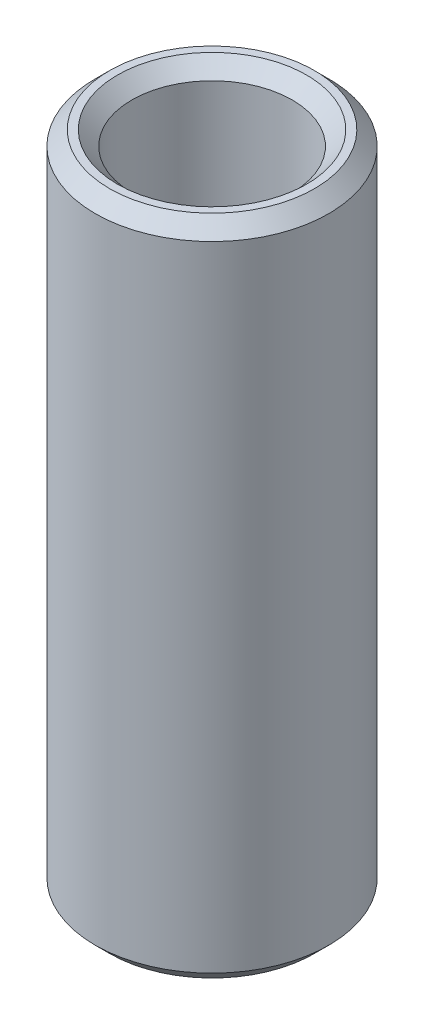
ISO-10303-21;
HEADER;
FILE_DESCRIPTION(('STEP AP214'),'2;1');
FILE_NAME('part.step','',(''),(''),'','','');
FILE_SCHEMA(('AUTOMOTIVE_DESIGN { 1 0 10303 214 1 1 1 1 }'));
ENDSEC;
DATA;
#1=APPLICATION_CONTEXT('core data for automotive mechanical design processes');
#2=APPLICATION_PROTOCOL_DEFINITION('international standard','automotive_design',2000,#1);
#3=PRODUCT_CONTEXT('',#1,'mechanical');
#4=PRODUCT('Part','Part','',(#3));
#5=PRODUCT_RELATED_PRODUCT_CATEGORY('part','',(#4));
#6=PRODUCT_DEFINITION_FORMATION('','',#4);
#7=PRODUCT_DEFINITION_CONTEXT('part definition',#1,'design');
#8=PRODUCT_DEFINITION('design','',#6,#7);
#9=PRODUCT_DEFINITION_SHAPE('','',#8);
#10=(LENGTH_UNIT() NAMED_UNIT(*) SI_UNIT(.MILLI.,.METRE.));
#11=(NAMED_UNIT(*) PLANE_ANGLE_UNIT() SI_UNIT($,.RADIAN.));
#12=(NAMED_UNIT(*) SI_UNIT($,.STERADIAN.) SOLID_ANGLE_UNIT());
#13=UNCERTAINTY_MEASURE_WITH_UNIT(LENGTH_MEASURE(1.E-05),#10,'distance_accuracy_value','');
#14=(GEOMETRIC_REPRESENTATION_CONTEXT(3) GLOBAL_UNCERTAINTY_ASSIGNED_CONTEXT((#13)) GLOBAL_UNIT_ASSIGNED_CONTEXT((#10,
#11,#12)) REPRESENTATION_CONTEXT('',''));
#15=CARTESIAN_POINT('',(0.,0.,0.));
#16=DIRECTION('',(0.,0.,1.));
#17=DIRECTION('',(1.,0.,0.));
#18=AXIS2_PLACEMENT_3D('',#15,#16,#17);
#19=CARTESIAN_POINT('',(0.,155.965716364162,0.));
#20=DIRECTION('',(0.,-1.,0.));
#21=DIRECTION('',(0.,0.,-1.));
#22=AXIS2_PLACEMENT_3D('',#19,#20,#21);
#23=CYLINDRICAL_SURFACE('',#22,27.5);
#24=CARTESIAN_POINT('',(0.,3.38961563517129,0.));
#25=DIRECTION('',(0.,1.,0.));
#26=DIRECTION('',(0.,0.,1.));
#27=AXIS2_PLACEMENT_3D('',#24,#25,#26);
#28=CIRCLE('',#27,27.5);
#29=CARTESIAN_POINT('',(0.,3.38961563517129,27.5));
#30=VERTEX_POINT('',#29);
#31=EDGE_CURVE('E10',#30,#30,#28,.T.);
#32=ORIENTED_EDGE('',*,*,#31,.T.);
#33=EDGE_LOOP('',(#32));
#34=FACE_BOUND('',#33,.T.);
#35=CARTESIAN_POINT('',(0.,152.57610072899,0.));
#36=DIRECTION('',(0.,1.,0.));
#37=DIRECTION('',(0.,0.,1.));
#38=AXIS2_PLACEMENT_3D('',#35,#36,#37);
#39=CIRCLE('',#38,27.5);
#40=CARTESIAN_POINT('',(0.,152.57610072899,27.5));
#41=VERTEX_POINT('',#40);
#42=EDGE_CURVE('E50',#41,#41,#39,.F.);
#43=ORIENTED_EDGE('',*,*,#42,.T.);
#44=EDGE_LOOP('',(#43));
#45=FACE_BOUND('',#44,.T.);
#46=ADVANCED_FACE('F39',(#34,#45),#23,.T.);
#47=CARTESIAN_POINT('',(0.,155.965716364162,0.));
#48=DIRECTION('',(0.,1.,0.));
#49=DIRECTION('',(0.,0.,1.));
#50=AXIS2_PLACEMENT_3D('',#47,#48,#49);
#51=PLANE('',#50);
#52=CARTESIAN_POINT('',(0.,155.965716364162,0.));
#53=DIRECTION('',(0.,1.,0.));
#54=DIRECTION('',(0.,0.,1.));
#55=AXIS2_PLACEMENT_3D('',#52,#53,#54);
#56=CIRCLE('',#55,22.2746414715789);
#57=CARTESIAN_POINT('',(0.,155.965716364162,22.2746414715789));
#58=VERTEX_POINT('',#57);
#59=EDGE_CURVE('E58',#58,#58,#56,.F.);
#60=ORIENTED_EDGE('',*,*,#59,.T.);
#61=EDGE_LOOP('',(#60));
#62=FACE_BOUND('',#61,.T.);
#63=CARTESIAN_POINT('',(0.,155.965716364162,0.));
#64=DIRECTION('',(0.,1.,0.));
#65=DIRECTION('',(0.,0.,1.));
#66=AXIS2_PLACEMENT_3D('',#63,#64,#65);
#67=CIRCLE('',#66,24.1103843648287);
#68=CARTESIAN_POINT('',(0.,155.965716364162,24.1103843648287));
#69=VERTEX_POINT('',#68);
#70=EDGE_CURVE('E61',#69,#69,#67,.T.);
#71=ORIENTED_EDGE('',*,*,#70,.T.);
#72=EDGE_LOOP('',(#71));
#73=FACE_BOUND('',#72,.T.);
#74=ADVANCED_FACE('F88',(#62,#73),#51,.T.);
#75=CARTESIAN_POINT('',(0.,0.,0.));
#76=DIRECTION('',(0.,1.,0.));
#77=DIRECTION('',(0.,0.,1.));
#78=AXIS2_PLACEMENT_3D('',#75,#76,#77);
#79=PLANE('',#78);
#80=CARTESIAN_POINT('',(0.,0.,0.));
#81=DIRECTION('',(0.,1.,0.));
#82=DIRECTION('',(0.,0.,1.));
#83=AXIS2_PLACEMENT_3D('',#80,#81,#82);
#84=CIRCLE('',#83,22.2746414715789);
#85=CARTESIAN_POINT('',(0.,0.,22.2746414715789));
#86=VERTEX_POINT('',#85);
#87=EDGE_CURVE('E51',#86,#86,#84,.T.);
#88=ORIENTED_EDGE('',*,*,#87,.T.);
#89=EDGE_LOOP('',(#88));
#90=FACE_BOUND('',#89,.T.);
#91=CARTESIAN_POINT('',(0.,0.,0.));
#92=DIRECTION('',(0.,1.,0.));
#93=DIRECTION('',(0.,0.,1.));
#94=AXIS2_PLACEMENT_3D('',#91,#92,#93);
#95=CIRCLE('',#94,24.1103843648287);
#96=CARTESIAN_POINT('',(0.,0.,24.1103843648287));
#97=VERTEX_POINT('',#96);
#98=EDGE_CURVE('E54',#97,#97,#95,.F.);
#99=ORIENTED_EDGE('',*,*,#98,.T.);
#100=EDGE_LOOP('',(#99));
#101=FACE_BOUND('',#100,.T.);
#102=ADVANCED_FACE('F83',(#90,#101),#79,.F.);
#103=CARTESIAN_POINT('',(0.,155.965716364162,0.));
#104=DIRECTION('',(0.,-1.,0.));
#105=DIRECTION('',(0.,0.,-1.));
#106=AXIS2_PLACEMENT_3D('',#103,#104,#105);
#107=CYLINDRICAL_SURFACE('',#106,18.8850258364076);
#108=CARTESIAN_POINT('',(0.,152.57610072899,0.));
#109=DIRECTION('',(0.,1.,0.));
#110=DIRECTION('',(0.,0.,1.));
#111=AXIS2_PLACEMENT_3D('',#108,#109,#110);
#112=CIRCLE('',#111,18.8850258364076);
#113=CARTESIAN_POINT('',(0.,152.57610072899,18.8850258364076));
#114=VERTEX_POINT('',#113);
#115=EDGE_CURVE('E67',#114,#114,#112,.T.);
#116=ORIENTED_EDGE('',*,*,#115,.T.);
#117=EDGE_LOOP('',(#116));
#118=FACE_BOUND('',#117,.T.);
#119=CARTESIAN_POINT('',(0.,3.38961563517132,0.));
#120=DIRECTION('',(0.,1.,0.));
#121=DIRECTION('',(0.,0.,1.));
#122=AXIS2_PLACEMENT_3D('',#119,#120,#121);
#123=CIRCLE('',#122,18.8850258364076);
#124=CARTESIAN_POINT('',(0.,3.38961563517132,18.8850258364076));
#125=VERTEX_POINT('',#124);
#126=EDGE_CURVE('E69',#125,#125,#123,.F.);
#127=ORIENTED_EDGE('',*,*,#126,.T.);
#128=EDGE_LOOP('',(#127));
#129=FACE_BOUND('',#128,.T.);
#130=ADVANCED_FACE('F71',(#118,#129),#107,.F.);
#131=CARTESIAN_POINT('',(0.,152.57610072899,0.));
#132=DIRECTION('',(0.,1.,0.));
#133=DIRECTION('',(0.,0.,1.));
#134=AXIS2_PLACEMENT_3D('',#131,#132,#133);
#135=CONICAL_SURFACE('',#134,18.8850258364076,0.785398163397448);
#136=ORIENTED_EDGE('',*,*,#59,.F.);
#137=EDGE_LOOP('',(#136));
#138=FACE_BOUND('',#137,.T.);
#139=ORIENTED_EDGE('',*,*,#115,.F.);
#140=EDGE_LOOP('',(#139));
#141=FACE_BOUND('',#140,.T.);
#142=ADVANCED_FACE('F77',(#138,#141),#135,.F.);
#143=CARTESIAN_POINT('',(0.,0.,0.));
#144=DIRECTION('',(0.,-1.,0.));
#145=DIRECTION('',(0.,0.,-1.));
#146=AXIS2_PLACEMENT_3D('',#143,#144,#145);
#147=CONICAL_SURFACE('',#146,22.2746414715789,0.785398163397446);
#148=ORIENTED_EDGE('',*,*,#126,.F.);
#149=EDGE_LOOP('',(#148));
#150=FACE_BOUND('',#149,.T.);
#151=ORIENTED_EDGE('',*,*,#87,.F.);
#152=EDGE_LOOP('',(#151));
#153=FACE_BOUND('',#152,.T.);
#154=ADVANCED_FACE('F73',(#150,#153),#147,.F.);
#155=CARTESIAN_POINT('',(0.,3.38961563517129,0.));
#156=DIRECTION('',(0.,1.,0.));
#157=DIRECTION('',(0.,0.,1.));
#158=AXIS2_PLACEMENT_3D('',#155,#156,#157);
#159=CONICAL_SURFACE('',#158,27.5,0.785398163397455);
#160=ORIENTED_EDGE('',*,*,#98,.F.);
#161=EDGE_LOOP('',(#160));
#162=FACE_BOUND('',#161,.T.);
#163=ORIENTED_EDGE('',*,*,#31,.F.);
#164=EDGE_LOOP('',(#163));
#165=FACE_BOUND('',#164,.T.);
#166=ADVANCED_FACE('F76',(#162,#165),#159,.T.);
#167=CARTESIAN_POINT('',(0.,155.965716364162,0.));
#168=DIRECTION('',(0.,-1.,0.));
#169=DIRECTION('',(0.,0.,-1.));
#170=AXIS2_PLACEMENT_3D('',#167,#168,#169);
#171=CONICAL_SURFACE('',#170,24.1103843648287,0.785398163397449);
#172=ORIENTED_EDGE('',*,*,#42,.F.);
#173=EDGE_LOOP('',(#172));
#174=FACE_BOUND('',#173,.T.);
#175=ORIENTED_EDGE('',*,*,#70,.F.);
#176=EDGE_LOOP('',(#175));
#177=FACE_BOUND('',#176,.T.);
#178=ADVANCED_FACE('F45',(#174,#177),#171,.T.);
#179=CLOSED_SHELL('',(#46,#74,#102,#130,#142,#154,#166,#178));
#180=MANIFOLD_SOLID_BREP('B2',#179);
#181=ADVANCED_BREP_SHAPE_REPRESENTATION('',(#18,#180),#14);
#182=SHAPE_DEFINITION_REPRESENTATION(#9,#181);
ENDSEC;
END-ISO-10303-21;
